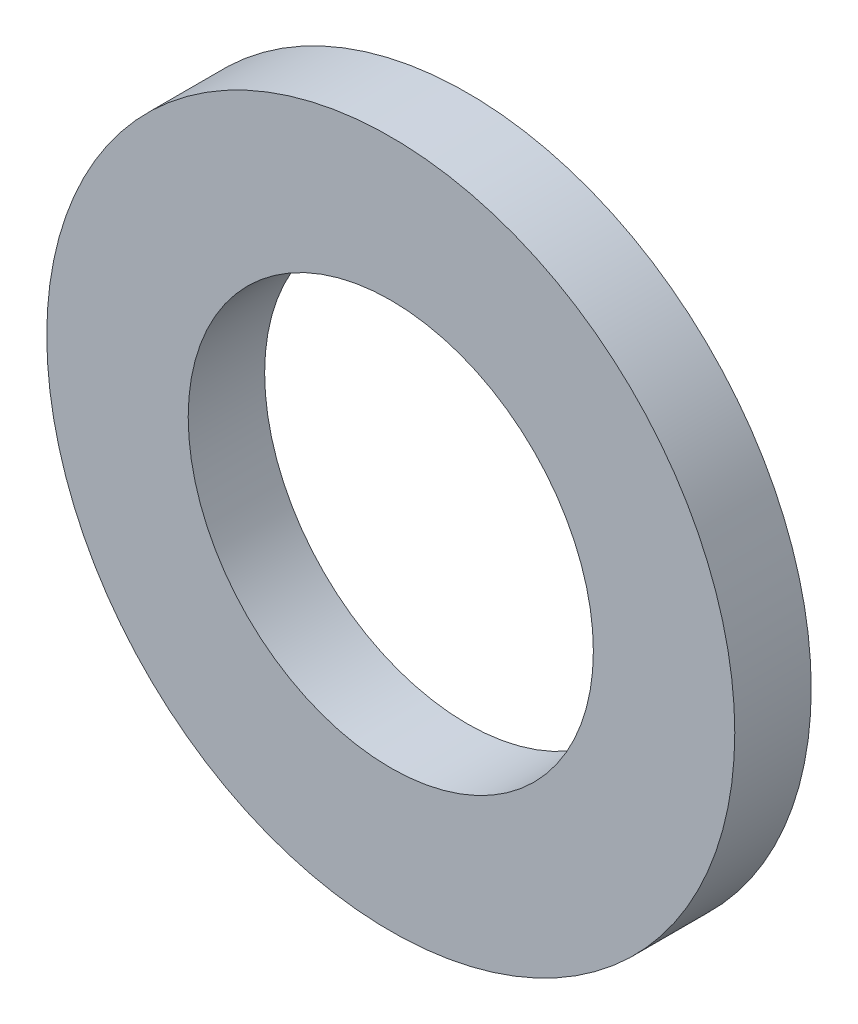
ISO-10303-21;
HEADER;
FILE_DESCRIPTION(('STEP AP214'),'2;1');
FILE_NAME('part.step','',(''),(''),'','','');
FILE_SCHEMA(('AUTOMOTIVE_DESIGN { 1 0 10303 214 1 1 1 1 }'));
ENDSEC;
DATA;
#1=APPLICATION_CONTEXT('core data for automotive mechanical design processes');
#2=APPLICATION_PROTOCOL_DEFINITION('international standard','automotive_design',2000,#1);
#3=PRODUCT_CONTEXT('',#1,'mechanical');
#4=PRODUCT('Part','Part','',(#3));
#5=PRODUCT_RELATED_PRODUCT_CATEGORY('part','',(#4));
#6=PRODUCT_DEFINITION_FORMATION('','',#4);
#7=PRODUCT_DEFINITION_CONTEXT('part definition',#1,'design');
#8=PRODUCT_DEFINITION('design','',#6,#7);
#9=PRODUCT_DEFINITION_SHAPE('','',#8);
#10=(LENGTH_UNIT() NAMED_UNIT(*) SI_UNIT(.MILLI.,.METRE.));
#11=(NAMED_UNIT(*) PLANE_ANGLE_UNIT() SI_UNIT($,.RADIAN.));
#12=(NAMED_UNIT(*) SI_UNIT($,.STERADIAN.) SOLID_ANGLE_UNIT());
#13=UNCERTAINTY_MEASURE_WITH_UNIT(LENGTH_MEASURE(1.E-05),#10,'distance_accuracy_value','');
#14=(GEOMETRIC_REPRESENTATION_CONTEXT(3) GLOBAL_UNCERTAINTY_ASSIGNED_CONTEXT((#13)) GLOBAL_UNIT_ASSIGNED_CONTEXT((#10,
#11,#12)) REPRESENTATION_CONTEXT('',''));
#15=CARTESIAN_POINT('',(0.,0.,0.));
#16=DIRECTION('',(0.,0.,1.));
#17=DIRECTION('',(1.,0.,0.));
#18=AXIS2_PLACEMENT_3D('',#15,#16,#17);
#19=CARTESIAN_POINT('',(0.,0.,1.));
#20=DIRECTION('',(0.,0.,1.));
#21=DIRECTION('',(1.,0.,0.));
#22=AXIS2_PLACEMENT_3D('',#19,#20,#21);
#23=PLANE('',#22);
#24=CARTESIAN_POINT('',(0.,0.,1.));
#25=DIRECTION('',(0.,0.,1.));
#26=DIRECTION('',(1.,0.,0.));
#27=AXIS2_PLACEMENT_3D('',#24,#25,#26);
#28=CIRCLE('',#27,4.5);
#29=CARTESIAN_POINT('',(4.5,0.,1.));
#30=VERTEX_POINT('',#29);
#31=EDGE_CURVE('E10',#30,#30,#28,.T.);
#32=ORIENTED_EDGE('',*,*,#31,.T.);
#33=EDGE_LOOP('',(#32));
#34=FACE_BOUND('',#33,.T.);
#35=CARTESIAN_POINT('',(0.,0.,1.));
#36=DIRECTION('',(0.,0.,1.));
#37=DIRECTION('',(1.,0.,0.));
#38=AXIS2_PLACEMENT_3D('',#35,#36,#37);
#39=CIRCLE('',#38,2.65);
#40=CARTESIAN_POINT('',(2.65,0.,1.));
#41=VERTEX_POINT('',#40);
#42=EDGE_CURVE('E42',#41,#41,#39,.T.);
#43=ORIENTED_EDGE('',*,*,#42,.F.);
#44=EDGE_LOOP('',(#43));
#45=FACE_BOUND('',#44,.T.);
#46=ADVANCED_FACE('F31',(#34,#45),#23,.T.);
#47=CARTESIAN_POINT('',(0.,0.,0.));
#48=DIRECTION('',(0.,0.,1.));
#49=DIRECTION('',(1.,0.,0.));
#50=AXIS2_PLACEMENT_3D('',#47,#48,#49);
#51=PLANE('',#50);
#52=CARTESIAN_POINT('',(0.,0.,0.));
#53=DIRECTION('',(0.,0.,1.));
#54=DIRECTION('',(1.,0.,0.));
#55=AXIS2_PLACEMENT_3D('',#52,#53,#54);
#56=CIRCLE('',#55,4.5);
#57=CARTESIAN_POINT('',(4.5,0.,0.));
#58=VERTEX_POINT('',#57);
#59=EDGE_CURVE('E35',#58,#58,#56,.T.);
#60=ORIENTED_EDGE('',*,*,#59,.F.);
#61=EDGE_LOOP('',(#60));
#62=FACE_BOUND('',#61,.T.);
#63=CARTESIAN_POINT('',(0.,0.,0.));
#64=DIRECTION('',(0.,0.,1.));
#65=DIRECTION('',(1.,0.,0.));
#66=AXIS2_PLACEMENT_3D('',#63,#64,#65);
#67=CIRCLE('',#66,2.65);
#68=CARTESIAN_POINT('',(2.65,0.,0.));
#69=VERTEX_POINT('',#68);
#70=EDGE_CURVE('E44',#69,#69,#67,.T.);
#71=ORIENTED_EDGE('',*,*,#70,.T.);
#72=EDGE_LOOP('',(#71));
#73=FACE_BOUND('',#72,.T.);
#74=ADVANCED_FACE('F54',(#62,#73),#51,.F.);
#75=CARTESIAN_POINT('',(0.,0.,1.));
#76=DIRECTION('',(0.,0.,-1.));
#77=DIRECTION('',(-1.,0.,0.));
#78=AXIS2_PLACEMENT_3D('',#75,#76,#77);
#79=CYLINDRICAL_SURFACE('',#78,4.5);
#80=ORIENTED_EDGE('',*,*,#31,.F.);
#81=EDGE_LOOP('',(#80));
#82=FACE_BOUND('',#81,.T.);
#83=ORIENTED_EDGE('',*,*,#59,.T.);
#84=EDGE_LOOP('',(#83));
#85=FACE_BOUND('',#84,.T.);
#86=ADVANCED_FACE('F33',(#82,#85),#79,.T.);
#87=CARTESIAN_POINT('',(0.,0.,1.));
#88=DIRECTION('',(0.,0.,-1.));
#89=DIRECTION('',(-1.,0.,0.));
#90=AXIS2_PLACEMENT_3D('',#87,#88,#89);
#91=CYLINDRICAL_SURFACE('',#90,2.65);
#92=ORIENTED_EDGE('',*,*,#42,.T.);
#93=EDGE_LOOP('',(#92));
#94=FACE_BOUND('',#93,.T.);
#95=ORIENTED_EDGE('',*,*,#70,.F.);
#96=EDGE_LOOP('',(#95));
#97=FACE_BOUND('',#96,.T.);
#98=ADVANCED_FACE('F50',(#94,#97),#91,.F.);
#99=CLOSED_SHELL('',(#46,#74,#86,#98));
#100=MANIFOLD_SOLID_BREP('B2',#99);
#101=ADVANCED_BREP_SHAPE_REPRESENTATION('',(#18,#100),#14);
#102=SHAPE_DEFINITION_REPRESENTATION(#9,#101);
ENDSEC;
END-ISO-10303-21;
